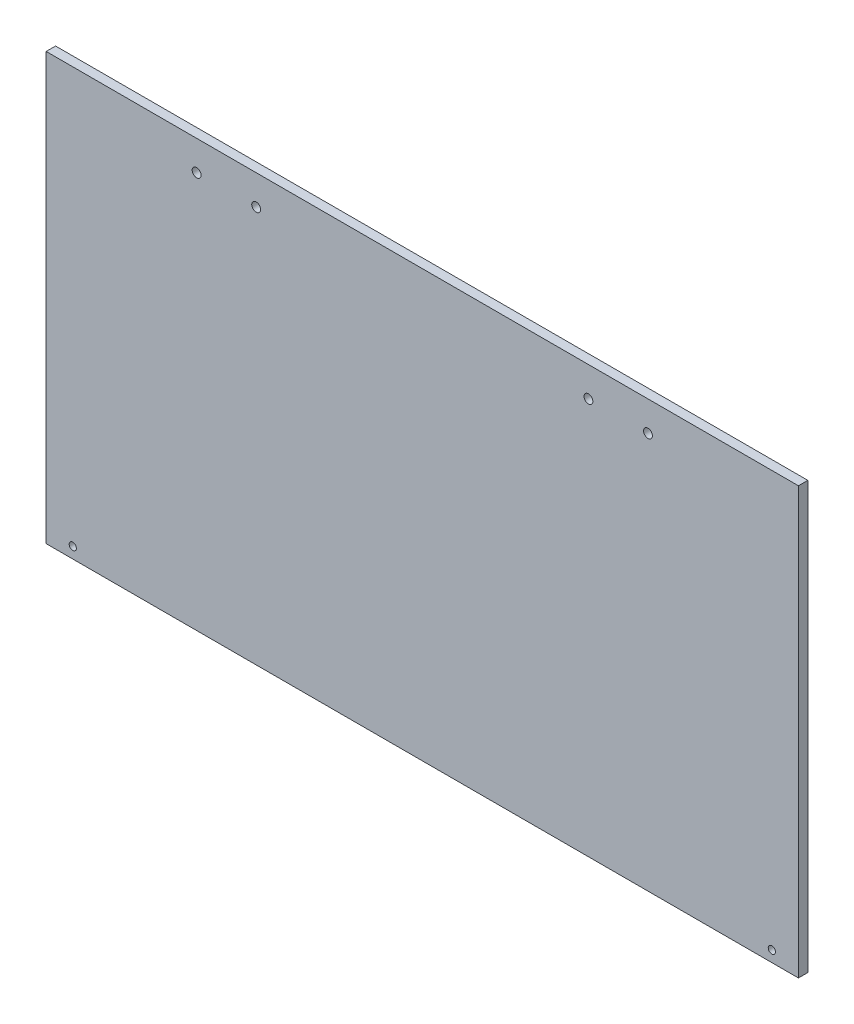
ISO-10303-21;
HEADER;
FILE_DESCRIPTION(('STEP AP214'),'2;1');
FILE_NAME('part.step','',(''),(''),'','','');
FILE_SCHEMA(('AUTOMOTIVE_DESIGN { 1 0 10303 214 1 1 1 1 }'));
ENDSEC;
DATA;
#1=APPLICATION_CONTEXT('core data for automotive mechanical design processes');
#2=APPLICATION_PROTOCOL_DEFINITION('international standard','automotive_design',2000,#1);
#3=PRODUCT_CONTEXT('',#1,'mechanical');
#4=PRODUCT('Part','Part','',(#3));
#5=PRODUCT_RELATED_PRODUCT_CATEGORY('part','',(#4));
#6=PRODUCT_DEFINITION_FORMATION('','',#4);
#7=PRODUCT_DEFINITION_CONTEXT('part definition',#1,'design');
#8=PRODUCT_DEFINITION('design','',#6,#7);
#9=PRODUCT_DEFINITION_SHAPE('','',#8);
#10=(LENGTH_UNIT() NAMED_UNIT(*) SI_UNIT(.MILLI.,.METRE.));
#11=(NAMED_UNIT(*) PLANE_ANGLE_UNIT() SI_UNIT($,.RADIAN.));
#12=(NAMED_UNIT(*) SI_UNIT($,.STERADIAN.) SOLID_ANGLE_UNIT());
#13=UNCERTAINTY_MEASURE_WITH_UNIT(LENGTH_MEASURE(1.E-05),#10,'distance_accuracy_value','');
#14=(GEOMETRIC_REPRESENTATION_CONTEXT(3) GLOBAL_UNCERTAINTY_ASSIGNED_CONTEXT((#13)) GLOBAL_UNIT_ASSIGNED_CONTEXT((#10,
#11,#12)) REPRESENTATION_CONTEXT('',''));
#15=CARTESIAN_POINT('',(0.,0.,0.));
#16=DIRECTION('',(0.,0.,1.));
#17=DIRECTION('',(1.,0.,0.));
#18=AXIS2_PLACEMENT_3D('',#15,#16,#17);
#19=CARTESIAN_POINT('',(190.5,107.95,4.7625));
#20=DIRECTION('',(-1.,0.,0.));
#21=DIRECTION('',(0.,-1.,0.));
#22=AXIS2_PLACEMENT_3D('',#19,#20,#21);
#23=PLANE('',#22);
#24=DIRECTION('',(0.,1.,0.));
#25=VECTOR('',#24,1.);
#26=CARTESIAN_POINT('',(190.5,107.95,0.));
#27=LINE('',#26,#25);
#28=CARTESIAN_POINT('',(190.5,-107.95,0.));
#29=VERTEX_POINT('',#28);
#30=CARTESIAN_POINT('',(190.5,107.95,0.));
#31=VERTEX_POINT('',#30);
#32=EDGE_CURVE('E98',#29,#31,#27,.T.);
#33=ORIENTED_EDGE('',*,*,#32,.T.);
#34=DIRECTION('',(0.,0.,-1.));
#35=VECTOR('',#34,1.);
#36=CARTESIAN_POINT('',(190.5,107.95,4.7625));
#37=LINE('',#36,#35);
#38=CARTESIAN_POINT('',(190.5,107.95,4.7625));
#39=VERTEX_POINT('',#38);
#40=EDGE_CURVE('E11',#39,#31,#37,.T.);
#41=ORIENTED_EDGE('',*,*,#40,.F.);
#42=DIRECTION('',(0.,1.,0.));
#43=VECTOR('',#42,1.);
#44=CARTESIAN_POINT('',(190.5,107.95,4.7625));
#45=LINE('',#44,#43);
#46=CARTESIAN_POINT('',(190.5,-107.95,4.7625));
#47=VERTEX_POINT('',#46);
#48=EDGE_CURVE('E85',#47,#39,#45,.T.);
#49=ORIENTED_EDGE('',*,*,#48,.F.);
#50=DIRECTION('',(0.,0.,-1.));
#51=VECTOR('',#50,1.);
#52=CARTESIAN_POINT('',(190.5,-107.95,4.7625));
#53=LINE('',#52,#51);
#54=EDGE_CURVE('E94',#47,#29,#53,.T.);
#55=ORIENTED_EDGE('',*,*,#54,.T.);
#56=EDGE_LOOP('',(#33,#41,#49,#55));
#57=FACE_BOUND('',#56,.T.);
#58=ADVANCED_FACE('F32',(#57),#23,.F.);
#59=CARTESIAN_POINT('',(-190.5,107.95,4.7625));
#60=DIRECTION('',(0.,-1.,0.));
#61=DIRECTION('',(0.,0.,-1.));
#62=AXIS2_PLACEMENT_3D('',#59,#60,#61);
#63=PLANE('',#62);
#64=DIRECTION('',(-1.,0.,0.));
#65=VECTOR('',#64,1.);
#66=CARTESIAN_POINT('',(-190.5,107.95,0.));
#67=LINE('',#66,#65);
#68=CARTESIAN_POINT('',(-190.5,107.95,0.));
#69=VERTEX_POINT('',#68);
#70=EDGE_CURVE('E89',#31,#69,#67,.T.);
#71=ORIENTED_EDGE('',*,*,#70,.T.);
#72=DIRECTION('',(0.,0.,-1.));
#73=VECTOR('',#72,1.);
#74=CARTESIAN_POINT('',(-190.5,107.95,4.7625));
#75=LINE('',#74,#73);
#76=CARTESIAN_POINT('',(-190.5,107.95,4.7625));
#77=VERTEX_POINT('',#76);
#78=EDGE_CURVE('E41',#77,#69,#75,.T.);
#79=ORIENTED_EDGE('',*,*,#78,.F.);
#80=DIRECTION('',(-1.,0.,0.));
#81=VECTOR('',#80,1.);
#82=CARTESIAN_POINT('',(-190.5,107.95,4.7625));
#83=LINE('',#82,#81);
#84=EDGE_CURVE('E80',#39,#77,#83,.T.);
#85=ORIENTED_EDGE('',*,*,#84,.F.);
#86=ORIENTED_EDGE('',*,*,#40,.T.);
#87=EDGE_LOOP('',(#71,#79,#85,#86));
#88=FACE_BOUND('',#87,.T.);
#89=ADVANCED_FACE('F88',(#88),#63,.F.);
#90=CARTESIAN_POINT('',(-190.5,107.95,4.7625));
#91=DIRECTION('',(1.,0.,0.));
#92=DIRECTION('',(0.,0.,-1.));
#93=AXIS2_PLACEMENT_3D('',#90,#91,#92);
#94=PLANE('',#93);
#95=DIRECTION('',(0.,-1.,0.));
#96=VECTOR('',#95,1.);
#97=CARTESIAN_POINT('',(-190.5,107.95,0.));
#98=LINE('',#97,#96);
#99=CARTESIAN_POINT('',(-190.5,-107.95,0.));
#100=VERTEX_POINT('',#99);
#101=EDGE_CURVE('E67',#69,#100,#98,.T.);
#102=ORIENTED_EDGE('',*,*,#101,.T.);
#103=DIRECTION('',(0.,0.,-1.));
#104=VECTOR('',#103,1.);
#105=CARTESIAN_POINT('',(-190.5,-107.95,4.7625));
#106=LINE('',#105,#104);
#107=CARTESIAN_POINT('',(-190.5,-107.95,4.7625));
#108=VERTEX_POINT('',#107);
#109=EDGE_CURVE('E90',#108,#100,#106,.T.);
#110=ORIENTED_EDGE('',*,*,#109,.F.);
#111=DIRECTION('',(0.,-1.,0.));
#112=VECTOR('',#111,1.);
#113=CARTESIAN_POINT('',(-190.5,107.95,4.7625));
#114=LINE('',#113,#112);
#115=EDGE_CURVE('E83',#77,#108,#114,.T.);
#116=ORIENTED_EDGE('',*,*,#115,.F.);
#117=ORIENTED_EDGE('',*,*,#78,.T.);
#118=EDGE_LOOP('',(#102,#110,#116,#117));
#119=FACE_BOUND('',#118,.T.);
#120=ADVANCED_FACE('F92',(#119),#94,.F.);
#121=CARTESIAN_POINT('',(-190.5,-107.95,4.7625));
#122=DIRECTION('',(0.,1.,0.));
#123=DIRECTION('',(0.,0.,1.));
#124=AXIS2_PLACEMENT_3D('',#121,#122,#123);
#125=PLANE('',#124);
#126=DIRECTION('',(1.,0.,0.));
#127=VECTOR('',#126,1.);
#128=CARTESIAN_POINT('',(-190.5,-107.95,0.));
#129=LINE('',#128,#127);
#130=EDGE_CURVE('E73',#100,#29,#129,.T.);
#131=ORIENTED_EDGE('',*,*,#130,.T.);
#132=ORIENTED_EDGE('',*,*,#54,.F.);
#133=DIRECTION('',(1.,0.,0.));
#134=VECTOR('',#133,1.);
#135=CARTESIAN_POINT('',(-190.5,-107.95,4.7625));
#136=LINE('',#135,#134);
#137=EDGE_CURVE('E50',#108,#47,#136,.T.);
#138=ORIENTED_EDGE('',*,*,#137,.F.);
#139=ORIENTED_EDGE('',*,*,#109,.T.);
#140=EDGE_LOOP('',(#131,#132,#138,#139));
#141=FACE_BOUND('',#140,.T.);
#142=ADVANCED_FACE('F156',(#141),#125,.F.);
#143=CARTESIAN_POINT('',(0.,0.,4.7625));
#144=DIRECTION('',(0.,0.,1.));
#145=DIRECTION('',(1.,0.,0.));
#146=AXIS2_PLACEMENT_3D('',#143,#144,#145);
#147=PLANE('',#146);
#148=CARTESIAN_POINT('',(-177.02911,-102.362,4.7625));
#149=DIRECTION('',(0.,0.,1.));
#150=DIRECTION('',(1.,0.,0.));
#151=AXIS2_PLACEMENT_3D('',#148,#149,#150);
#152=CIRCLE('',#151,1.82879999999999);
#153=CARTESIAN_POINT('',(-175.20031,-102.362,4.7625));
#154=VERTEX_POINT('',#153);
#155=EDGE_CURVE('E246',#154,#154,#152,.T.);
#156=ORIENTED_EDGE('',*,*,#155,.F.);
#157=EDGE_LOOP('',(#156));
#158=FACE_BOUND('',#157,.T.);
#159=CARTESIAN_POINT('',(177.02911,-102.362,4.7625));
#160=DIRECTION('',(0.,0.,1.));
#161=DIRECTION('',(1.,0.,0.));
#162=AXIS2_PLACEMENT_3D('',#159,#160,#161);
#163=CIRCLE('',#162,1.82879999999999);
#164=CARTESIAN_POINT('',(178.85791,-102.362,4.7625));
#165=VERTEX_POINT('',#164);
#166=EDGE_CURVE('E250',#165,#165,#163,.T.);
#167=ORIENTED_EDGE('',*,*,#166,.F.);
#168=EDGE_LOOP('',(#167));
#169=FACE_BOUND('',#168,.T.);
#170=CARTESIAN_POINT('',(-114.3,92.86875,4.7625));
#171=DIRECTION('',(0.,0.,1.));
#172=DIRECTION('',(1.,0.,0.));
#173=AXIS2_PLACEMENT_3D('',#170,#171,#172);
#174=CIRCLE('',#173,2.24789999999998);
#175=CARTESIAN_POINT('',(-112.0521,92.86875,4.7625));
#176=VERTEX_POINT('',#175);
#177=EDGE_CURVE('E123',#176,#176,#174,.T.);
#178=ORIENTED_EDGE('',*,*,#177,.F.);
#179=EDGE_LOOP('',(#178));
#180=FACE_BOUND('',#179,.T.);
#181=CARTESIAN_POINT('',(-84.1375,92.86875,4.7625));
#182=DIRECTION('',(0.,0.,1.));
#183=DIRECTION('',(1.,0.,0.));
#184=AXIS2_PLACEMENT_3D('',#181,#182,#183);
#185=CIRCLE('',#184,2.24789999999998);
#186=CARTESIAN_POINT('',(-81.8896,92.86875,4.7625));
#187=VERTEX_POINT('',#186);
#188=EDGE_CURVE('E113',#187,#187,#185,.T.);
#189=ORIENTED_EDGE('',*,*,#188,.F.);
#190=EDGE_LOOP('',(#189));
#191=FACE_BOUND('',#190,.T.);
#192=CARTESIAN_POINT('',(84.1375,92.86875,4.7625));
#193=DIRECTION('',(0.,0.,1.));
#194=DIRECTION('',(1.,0.,0.));
#195=AXIS2_PLACEMENT_3D('',#192,#193,#194);
#196=CIRCLE('',#195,2.24789999999998);
#197=CARTESIAN_POINT('',(86.3854,92.86875,4.7625));
#198=VERTEX_POINT('',#197);
#199=EDGE_CURVE('E110',#198,#198,#196,.T.);
#200=ORIENTED_EDGE('',*,*,#199,.F.);
#201=EDGE_LOOP('',(#200));
#202=FACE_BOUND('',#201,.T.);
#203=CARTESIAN_POINT('',(114.3,92.86875,4.7625));
#204=DIRECTION('',(0.,0.,1.));
#205=DIRECTION('',(1.,0.,0.));
#206=AXIS2_PLACEMENT_3D('',#203,#204,#205);
#207=CIRCLE('',#206,2.24789999999998);
#208=CARTESIAN_POINT('',(116.5479,92.86875,4.7625));
#209=VERTEX_POINT('',#208);
#210=EDGE_CURVE('E109',#209,#209,#207,.T.);
#211=ORIENTED_EDGE('',*,*,#210,.F.);
#212=EDGE_LOOP('',(#211));
#213=FACE_BOUND('',#212,.T.);
#214=ORIENTED_EDGE('',*,*,#48,.T.);
#215=ORIENTED_EDGE('',*,*,#84,.T.);
#216=ORIENTED_EDGE('',*,*,#115,.T.);
#217=ORIENTED_EDGE('',*,*,#137,.T.);
#218=EDGE_LOOP('',(#214,#215,#216,#217));
#219=FACE_BOUND('',#218,.T.);
#220=ADVANCED_FACE('F81',(#158,#169,#180,#191,#202,#213,#219),#147,.T.);
#221=CARTESIAN_POINT('',(0.,0.,0.));
#222=DIRECTION('',(0.,0.,1.));
#223=DIRECTION('',(1.,0.,0.));
#224=AXIS2_PLACEMENT_3D('',#221,#222,#223);
#225=PLANE('',#224);
#226=CARTESIAN_POINT('',(-177.02911,-102.362,0.));
#227=DIRECTION('',(0.,0.,1.));
#228=DIRECTION('',(1.,0.,0.));
#229=AXIS2_PLACEMENT_3D('',#226,#227,#228);
#230=CIRCLE('',#229,1.82879999999999);
#231=CARTESIAN_POINT('',(-175.20031,-102.362,0.));
#232=VERTEX_POINT('',#231);
#233=EDGE_CURVE('E249',#232,#232,#230,.T.);
#234=ORIENTED_EDGE('',*,*,#233,.T.);
#235=EDGE_LOOP('',(#234));
#236=FACE_BOUND('',#235,.T.);
#237=CARTESIAN_POINT('',(177.02911,-102.362,0.));
#238=DIRECTION('',(0.,0.,1.));
#239=DIRECTION('',(1.,0.,0.));
#240=AXIS2_PLACEMENT_3D('',#237,#238,#239);
#241=CIRCLE('',#240,1.82879999999999);
#242=CARTESIAN_POINT('',(178.85791,-102.362,0.));
#243=VERTEX_POINT('',#242);
#244=EDGE_CURVE('E253',#243,#243,#241,.T.);
#245=ORIENTED_EDGE('',*,*,#244,.T.);
#246=EDGE_LOOP('',(#245));
#247=FACE_BOUND('',#246,.T.);
#248=CARTESIAN_POINT('',(-114.3,92.86875,0.));
#249=DIRECTION('',(0.,0.,1.));
#250=DIRECTION('',(1.,0.,0.));
#251=AXIS2_PLACEMENT_3D('',#248,#249,#250);
#252=CIRCLE('',#251,2.24789999999998);
#253=CARTESIAN_POINT('',(-112.0521,92.86875,0.));
#254=VERTEX_POINT('',#253);
#255=EDGE_CURVE('E35',#254,#254,#252,.T.);
#256=ORIENTED_EDGE('',*,*,#255,.T.);
#257=EDGE_LOOP('',(#256));
#258=FACE_BOUND('',#257,.T.);
#259=CARTESIAN_POINT('',(-84.1375,92.86875,0.));
#260=DIRECTION('',(0.,0.,1.));
#261=DIRECTION('',(1.,0.,0.));
#262=AXIS2_PLACEMENT_3D('',#259,#260,#261);
#263=CIRCLE('',#262,2.24789999999998);
#264=CARTESIAN_POINT('',(-81.8896,92.86875,0.));
#265=VERTEX_POINT('',#264);
#266=EDGE_CURVE('E111',#265,#265,#263,.T.);
#267=ORIENTED_EDGE('',*,*,#266,.T.);
#268=EDGE_LOOP('',(#267));
#269=FACE_BOUND('',#268,.T.);
#270=CARTESIAN_POINT('',(84.1375,92.86875,0.));
#271=DIRECTION('',(0.,0.,1.));
#272=DIRECTION('',(1.,0.,0.));
#273=AXIS2_PLACEMENT_3D('',#270,#271,#272);
#274=CIRCLE('',#273,2.24789999999998);
#275=CARTESIAN_POINT('',(86.3854,92.86875,0.));
#276=VERTEX_POINT('',#275);
#277=EDGE_CURVE('E107',#276,#276,#274,.T.);
#278=ORIENTED_EDGE('',*,*,#277,.T.);
#279=EDGE_LOOP('',(#278));
#280=FACE_BOUND('',#279,.T.);
#281=CARTESIAN_POINT('',(114.3,92.86875,0.));
#282=DIRECTION('',(0.,0.,1.));
#283=DIRECTION('',(1.,0.,0.));
#284=AXIS2_PLACEMENT_3D('',#281,#282,#283);
#285=CIRCLE('',#284,2.24789999999998);
#286=CARTESIAN_POINT('',(116.5479,92.86875,0.));
#287=VERTEX_POINT('',#286);
#288=EDGE_CURVE('E101',#287,#287,#285,.T.);
#289=ORIENTED_EDGE('',*,*,#288,.T.);
#290=EDGE_LOOP('',(#289));
#291=FACE_BOUND('',#290,.T.);
#292=ORIENTED_EDGE('',*,*,#32,.F.);
#293=ORIENTED_EDGE('',*,*,#130,.F.);
#294=ORIENTED_EDGE('',*,*,#101,.F.);
#295=ORIENTED_EDGE('',*,*,#70,.F.);
#296=EDGE_LOOP('',(#292,#293,#294,#295));
#297=FACE_BOUND('',#296,.T.);
#298=ADVANCED_FACE('F132',(#236,#247,#258,#269,#280,#291,#297),#225,.F.);
#299=CARTESIAN_POINT('',(114.3,92.86875,4.7625));
#300=DIRECTION('',(0.,0.,1.));
#301=DIRECTION('',(1.,0.,0.));
#302=AXIS2_PLACEMENT_3D('',#299,#300,#301);
#303=CYLINDRICAL_SURFACE('',#302,2.24789999999998);
#304=ORIENTED_EDGE('',*,*,#210,.T.);
#305=EDGE_LOOP('',(#304));
#306=FACE_BOUND('',#305,.T.);
#307=ORIENTED_EDGE('',*,*,#288,.F.);
#308=EDGE_LOOP('',(#307));
#309=FACE_BOUND('',#308,.T.);
#310=ADVANCED_FACE('F135',(#306,#309),#303,.F.);
#311=CARTESIAN_POINT('',(84.1375,92.86875,4.7625));
#312=DIRECTION('',(0.,0.,1.));
#313=DIRECTION('',(1.,0.,0.));
#314=AXIS2_PLACEMENT_3D('',#311,#312,#313);
#315=CYLINDRICAL_SURFACE('',#314,2.24789999999998);
#316=ORIENTED_EDGE('',*,*,#199,.T.);
#317=EDGE_LOOP('',(#316));
#318=FACE_BOUND('',#317,.T.);
#319=ORIENTED_EDGE('',*,*,#277,.F.);
#320=EDGE_LOOP('',(#319));
#321=FACE_BOUND('',#320,.T.);
#322=ADVANCED_FACE('F137',(#318,#321),#315,.F.);
#323=CARTESIAN_POINT('',(-84.1375,92.86875,4.7625));
#324=DIRECTION('',(0.,0.,1.));
#325=DIRECTION('',(1.,0.,0.));
#326=AXIS2_PLACEMENT_3D('',#323,#324,#325);
#327=CYLINDRICAL_SURFACE('',#326,2.24789999999998);
#328=ORIENTED_EDGE('',*,*,#188,.T.);
#329=EDGE_LOOP('',(#328));
#330=FACE_BOUND('',#329,.T.);
#331=ORIENTED_EDGE('',*,*,#266,.F.);
#332=EDGE_LOOP('',(#331));
#333=FACE_BOUND('',#332,.T.);
#334=ADVANCED_FACE('F144',(#330,#333),#327,.F.);
#335=CARTESIAN_POINT('',(-114.3,92.86875,4.7625));
#336=DIRECTION('',(0.,0.,1.));
#337=DIRECTION('',(1.,0.,0.));
#338=AXIS2_PLACEMENT_3D('',#335,#336,#337);
#339=CYLINDRICAL_SURFACE('',#338,2.24789999999998);
#340=ORIENTED_EDGE('',*,*,#177,.T.);
#341=EDGE_LOOP('',(#340));
#342=FACE_BOUND('',#341,.T.);
#343=ORIENTED_EDGE('',*,*,#255,.F.);
#344=EDGE_LOOP('',(#343));
#345=FACE_BOUND('',#344,.T.);
#346=ADVANCED_FACE('F212',(#342,#345),#339,.F.);
#347=CARTESIAN_POINT('',(177.02911,-102.362,4.7625));
#348=DIRECTION('',(0.,0.,1.));
#349=DIRECTION('',(1.,0.,0.));
#350=AXIS2_PLACEMENT_3D('',#347,#348,#349);
#351=CYLINDRICAL_SURFACE('',#350,1.82879999999999);
#352=ORIENTED_EDGE('',*,*,#166,.T.);
#353=EDGE_LOOP('',(#352));
#354=FACE_BOUND('',#353,.T.);
#355=ORIENTED_EDGE('',*,*,#244,.F.);
#356=EDGE_LOOP('',(#355));
#357=FACE_BOUND('',#356,.T.);
#358=ADVANCED_FACE('F219',(#354,#357),#351,.F.);
#359=CARTESIAN_POINT('',(-177.02911,-102.362,4.7625));
#360=DIRECTION('',(0.,0.,1.));
#361=DIRECTION('',(1.,0.,0.));
#362=AXIS2_PLACEMENT_3D('',#359,#360,#361);
#363=CYLINDRICAL_SURFACE('',#362,1.82879999999999);
#364=ORIENTED_EDGE('',*,*,#155,.T.);
#365=EDGE_LOOP('',(#364));
#366=FACE_BOUND('',#365,.T.);
#367=ORIENTED_EDGE('',*,*,#233,.F.);
#368=EDGE_LOOP('',(#367));
#369=FACE_BOUND('',#368,.T.);
#370=ADVANCED_FACE('F227',(#366,#369),#363,.F.);
#371=CLOSED_SHELL('',(#58,#89,#120,#142,#220,#298,#310,#322,#334,#346,#358,#370));
#372=MANIFOLD_SOLID_BREP('B2',#371);
#373=ADVANCED_BREP_SHAPE_REPRESENTATION('',(#18,#372),#14);
#374=SHAPE_DEFINITION_REPRESENTATION(#9,#373);
ENDSEC;
END-ISO-10303-21;
